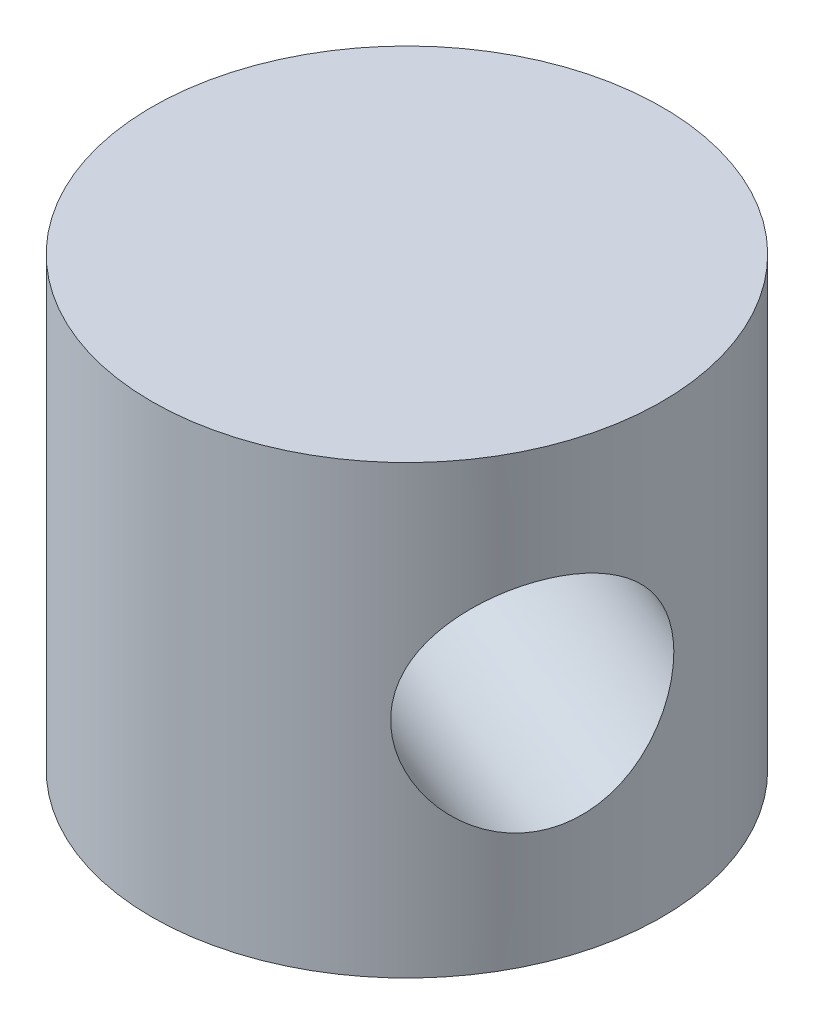
ISO-10303-21;
HEADER;
FILE_DESCRIPTION(('STEP AP214'),'2;1');
FILE_NAME('part.step','',(''),(''),'','','');
FILE_SCHEMA(('AUTOMOTIVE_DESIGN { 1 0 10303 214 1 1 1 1 }'));
ENDSEC;
DATA;
#1=APPLICATION_CONTEXT('core data for automotive mechanical design processes');
#2=APPLICATION_PROTOCOL_DEFINITION('international standard','automotive_design',2000,#1);
#3=PRODUCT_CONTEXT('',#1,'mechanical');
#4=PRODUCT('Part','Part','',(#3));
#5=PRODUCT_RELATED_PRODUCT_CATEGORY('part','',(#4));
#6=PRODUCT_DEFINITION_FORMATION('','',#4);
#7=PRODUCT_DEFINITION_CONTEXT('part definition',#1,'design');
#8=PRODUCT_DEFINITION('design','',#6,#7);
#9=PRODUCT_DEFINITION_SHAPE('','',#8);
#10=(LENGTH_UNIT() NAMED_UNIT(*) SI_UNIT(.MILLI.,.METRE.));
#11=(NAMED_UNIT(*) PLANE_ANGLE_UNIT() SI_UNIT($,.RADIAN.));
#12=(NAMED_UNIT(*) SI_UNIT($,.STERADIAN.) SOLID_ANGLE_UNIT());
#13=UNCERTAINTY_MEASURE_WITH_UNIT(LENGTH_MEASURE(1.E-05),#10,'distance_accuracy_value','');
#14=(GEOMETRIC_REPRESENTATION_CONTEXT(3) GLOBAL_UNCERTAINTY_ASSIGNED_CONTEXT((#13)) GLOBAL_UNIT_ASSIGNED_CONTEXT((#10,
#11,#12)) REPRESENTATION_CONTEXT('',''));
#15=CARTESIAN_POINT('',(0.,0.,0.));
#16=DIRECTION('',(0.,0.,1.));
#17=DIRECTION('',(1.,0.,0.));
#18=AXIS2_PLACEMENT_3D('',#15,#16,#17);
#19=CARTESIAN_POINT('',(0.,14.,0.));
#20=DIRECTION('',(0.,-1.,0.));
#21=DIRECTION('',(0.,0.,-1.));
#22=AXIS2_PLACEMENT_3D('',#19,#20,#21);
#23=CYLINDRICAL_SURFACE('',#22,8.);
#24=CARTESIAN_POINT('',(-5.39501646217355,7.,-5.90709720360825));
#25=CARTESIAN_POINT('',(-5.39501739878358,7.090523000141,-5.90709683834963));
#26=CARTESIAN_POINT('',(-5.39797305114615,7.18107623981146,-5.90440113833846));
#27=CARTESIAN_POINT('',(-5.40972838466958,7.36151941316238,-5.89363215856105));
#28=CARTESIAN_POINT('',(-5.41853178209816,7.45140888826371,-5.88555545913628));
#29=CARTESIAN_POINT('',(-5.44180280582978,7.63000304311961,-5.86404592315097));
#30=CARTESIAN_POINT('',(-5.45628220802113,7.71870486063056,-5.8506019501442));
#31=CARTESIAN_POINT('',(-5.49056930838726,7.89411067449536,-5.81843579403287));
#32=CARTESIAN_POINT('',(-5.51037925402175,7.9808138113885,-5.79971138443429));
#33=CARTESIAN_POINT('',(-5.57699313684112,8.23625324629269,-5.73593531244464));
#34=CARTESIAN_POINT('',(-5.63111222383345,8.40127467876389,-5.68316546566976));
#35=CARTESIAN_POINT('',(-5.75479417536612,8.71719474429244,-5.55788143992096));
#36=CARTESIAN_POINT('',(-5.82435382013894,8.86809631240543,-5.48537137659514));
#37=CARTESIAN_POINT('',(-5.97903292376719,9.16147371576962,-5.31648501375161));
#38=CARTESIAN_POINT('',(-6.06482664213419,9.30293294943535,-5.21895640973586));
#39=CARTESIAN_POINT('',(-6.24380942049427,9.56398304906696,-5.00344439772505));
#40=CARTESIAN_POINT('',(-6.3370013790544,9.68356528257335,-4.88545295090331));
#41=CARTESIAN_POINT('',(-6.53008806399734,9.90274296827423,-4.62443965861667));
#42=CARTESIAN_POINT('',(-6.6300949283572,10.0011830704645,-4.48052394945592));
#43=CARTESIAN_POINT('',(-6.82712801093451,10.1674229235738,-4.17413669302737));
#44=CARTESIAN_POINT('',(-6.92415558374197,10.2352367974497,-4.0116737420107));
#45=CARTESIAN_POINT('',(-7.10503499192602,10.3345791988528,-3.68130491328499));
#46=CARTESIAN_POINT('',(-7.18931506350882,10.3678659539145,-3.51416397127766));
#47=CARTESIAN_POINT('',(-7.34685759134396,10.4029004598221,-3.17161830124841));
#48=CARTESIAN_POINT('',(-7.42012469510924,10.4046615518764,-2.99621710035895));
#49=CARTESIAN_POINT('',(-7.54897496223702,10.3774940595107,-2.65410946833767));
#50=CARTESIAN_POINT('',(-7.60538369816813,10.3505001780629,-2.4875550739392));
#51=CARTESIAN_POINT('',(-7.70561818019824,10.2699187884587,-2.15714313858101));
#52=CARTESIAN_POINT('',(-7.74944299662975,10.2163293162862,-1.9932857977152));
#53=CARTESIAN_POINT('',(-7.82543972038249,10.0834554496467,-1.67046030653175));
#54=CARTESIAN_POINT('',(-7.85742312056618,10.003790544129,-1.51160528670168));
#55=CARTESIAN_POINT('',(-7.91014572178526,9.82140939840707,-1.205704564771));
#56=CARTESIAN_POINT('',(-7.93088089205663,9.71868491350131,-1.05866311207953));
#57=CARTESIAN_POINT('',(-7.96427257621075,9.48439898425984,-0.770052662821825));
#58=CARTESIAN_POINT('',(-7.97622976797715,9.35128100486895,-0.629664514422268));
#59=CARTESIAN_POINT('',(-7.99243128574457,9.06435209734065,-0.371267150105787));
#60=CARTESIAN_POINT('',(-7.99667239651045,8.91053257167743,-0.253267281559057));
#61=CARTESIAN_POINT('',(-8.00063335493223,8.57971966238651,-0.0403728986407438));
#62=CARTESIAN_POINT('',(-8.00018803421697,8.40209919226044,0.0535571126369195));
#63=CARTESIAN_POINT('',(-7.99767741778646,8.03283896754991,0.207787237190188));
#64=CARTESIAN_POINT('',(-7.99561333750852,7.84120982915227,0.268112524301288));
#65=CARTESIAN_POINT('',(-7.99249941027851,7.46300339602884,0.348536744928496));
#66=CARTESIAN_POINT('',(-7.99139109378033,7.27694176494296,0.371050528466116));
#67=CARTESIAN_POINT('',(-7.99087830684536,6.90384753499212,0.381986516522997));
#68=CARTESIAN_POINT('',(-7.99147320612462,6.7168153208653,0.370421332096988));
#69=CARTESIAN_POINT('',(-7.99379879202815,6.36046323481976,0.315939263595305));
#70=CARTESIAN_POINT('',(-7.99544974833354,6.19080215586855,0.275200897953546));
#71=CARTESIAN_POINT('',(-7.99843890884735,5.86025433904409,0.166981919420543));
#72=CARTESIAN_POINT('',(-7.99977703784189,5.69936971843113,0.0994948857697852));
#73=CARTESIAN_POINT('',(-8.00018095394254,5.38317309821528,-0.0627056027196794));
#74=CARTESIAN_POINT('',(-7.9991461862667,5.2284012075454,-0.158468327204054));
#75=CARTESIAN_POINT('',(-7.9920484312117,4.93520988068559,-0.372280855343809));
#76=CARTESIAN_POINT('',(-7.98598320313174,4.79679776296835,-0.490340572571313));
#77=CARTESIAN_POINT('',(-7.96540147158254,4.52795243224838,-0.75603037960453));
#78=CARTESIAN_POINT('',(-7.95020782645414,4.39920853374453,-0.90532429065251));
#79=CARTESIAN_POINT('',(-7.90784815806925,4.16735177931507,-1.22118937922614));
#80=CARTESIAN_POINT('',(-7.8806810370567,4.06424127487457,-1.38776213984588));
#81=CARTESIAN_POINT('',(-7.81187589218991,3.8865339544999,-1.73372103592866));
#82=CARTESIAN_POINT('',(-7.77017793115304,3.81205796957249,-1.91315775951674));
#83=CARTESIAN_POINT('',(-7.67111923991,3.69530599113611,-2.27806423388292));
#84=CARTESIAN_POINT('',(-7.61376828047193,3.65300997272457,-2.4635301577628));
#85=CARTESIAN_POINT('',(-7.48856302688684,3.60441379589686,-2.82038737521534));
#86=CARTESIAN_POINT('',(-7.42176634007661,3.59573473320773,-2.9918278464269));
#87=CARTESIAN_POINT('',(-7.27689056077471,3.60816517201317,-3.32873267617656));
#88=CARTESIAN_POINT('',(-7.19881359295291,3.62926907035936,-3.49419815280058));
#89=CARTESIAN_POINT('',(-7.03752588374139,3.69895846425078,-3.8083138214667));
#90=CARTESIAN_POINT('',(-6.95462311459545,3.7464688021909,-3.95736411795975));
#91=CARTESIAN_POINT('',(-6.78452656235538,3.86642559559092,-4.24237771735119));
#92=CARTESIAN_POINT('',(-6.69733198420749,3.93887668631584,-4.37833858154996));
#93=CARTESIAN_POINT('',(-6.51837661334299,4.11032785222912,-4.64081312878653));
#94=CARTESIAN_POINT('',(-6.42658863842499,4.210386305035,-4.76661506483792));
#95=CARTESIAN_POINT('',(-6.24675204823898,4.43270568683477,-4.99998290326825));
#96=CARTESIAN_POINT('',(-6.15870490272508,4.55497524472993,-5.10754168676177));
#97=CARTESIAN_POINT('',(-5.98487935028355,4.82846913105678,-5.31039702104811));
#98=CARTESIAN_POINT('',(-5.89970958865767,4.98113579405702,-5.40427382006541));
#99=CARTESIAN_POINT('',(-5.74445925952968,5.30571720020382,-5.56902704624976));
#100=CARTESIAN_POINT('',(-5.67438736386862,5.47764291957361,-5.63989026677576));
#101=CARTESIAN_POINT('',(-5.58499732637856,5.74625304577109,-5.72796096454177));
#102=CARTESIAN_POINT('',(-5.55783643769012,5.83749594424632,-5.75426611146949));
#103=CARTESIAN_POINT('',(-5.50930716636968,6.02301719311669,-5.80074719210668));
#104=CARTESIAN_POINT('',(-5.48793592547853,6.1172940198946,-5.82092615081591));
#105=CARTESIAN_POINT('',(-5.45157211083415,6.30791085175489,-5.8549962506666));
#106=CARTESIAN_POINT('',(-5.43656272956912,6.40424470520901,-5.86890396621116));
#107=CARTESIAN_POINT('',(-5.41325108022949,6.59836825439456,-5.89041320331085));
#108=CARTESIAN_POINT('',(-5.40494364955115,6.69615677032478,-5.89801957899548));
#109=CARTESIAN_POINT('',(-5.39840543589642,6.82846821876692,-5.90400045131156));
#110=CARTESIAN_POINT('',(-5.39713526767001,6.86275023837152,-5.90516147959401));
#111=CARTESIAN_POINT('',(-5.39544059739817,6.93135338895923,-5.90670993033011));
#112=CARTESIAN_POINT('',(-5.39501610701974,6.9656745204754,-5.90709734211092));
#113=CARTESIAN_POINT('',(-5.39501646217355,7.,-5.90709720360825));
#114=B_SPLINE_CURVE_WITH_KNOTS('',3,(#24,#25,#26,#27,#28,#29,#30,#31,#32,#33,#34,#35,#36,#37,
#38,#39,#40,#41,#42,#43,#44,#45,#46,#47,#48,#49,#50,#51,#52,#53,#54,#55,#56,#57,#58,#59,#60,#61,
#62,#63,#64,#65,#66,#67,#68,#69,#70,#71,#72,#73,#74,#75,#76,#77,#78,#79,#80,#81,#82,#83,#84,#85,
#86,#87,#88,#89,#90,#91,#92,#93,#94,#95,#96,#97,#98,#99,#100,#101,#102,#103,#104,#105,#106,#107,
#108,#109,#110,#111,#112,#113),.UNSPECIFIED.,.T.,.F.,(4,2,2,2,2,2,2,2,2,2,2,2,2,2,2,2,2,2,2,2,2,
2,2,2,2,2,2,2,2,2,2,2,2,2,2,2,2,2,2,2,2,2,2,2,4),(0.,0.271533101303065,0.543238928388109,
0.815511466907409,1.08789898112825,1.62979796627975,2.17158405703762,2.74521548008885,
3.31907276680709,3.91901055560994,4.518671406341,5.08602169361362,5.65313188070349,
6.18436069062124,6.71562873626018,7.25502349345062,7.79461141340451,8.37354466653554,
8.95271910176149,9.55237239074671,10.1515758637073,10.7108099920759,11.2698371996708,
11.7909672889951,12.3122225463985,12.8559725303037,13.3999648450627,13.9903875055115,
14.5808643085448,15.1738061326552,15.7663786793264,16.3161578611251,16.8658336252783,
17.3946144745139,17.9234936513282,18.4764471857591,19.029616001036,19.622198872516,
20.2151212069326,20.5110879967455,20.8069084049778,21.1019423336194,21.3967487760209,
21.4997101815325,21.602673007494),.UNSPECIFIED.);
#115=CARTESIAN_POINT('',(-5.39501646217355,7.,-5.90709720360825));
#116=VERTEX_POINT('',#115);
#117=EDGE_CURVE('E45',#116,#116,#114,.T.);
#118=ORIENTED_EDGE('',*,*,#117,.T.);
#119=EDGE_LOOP('',(#118));
#120=FACE_BOUND('',#119,.T.);
#121=CARTESIAN_POINT('',(7.99107210329432,7.,-0.377844729950489));
#122=CARTESIAN_POINT('',(7.99107250911416,6.909476999859,-0.377843810188309));
#123=CARTESIAN_POINT('',(7.99126419807367,6.81892376018854,-0.373848070609539));
#124=CARTESIAN_POINT('',(7.99199304211696,6.63848058683762,-0.357922381360591));
#125=CARTESIAN_POINT('',(7.99253041687871,6.54859111173629,-0.345987386251714));
#126=CARTESIAN_POINT('',(7.99383837678548,6.36999695688039,-0.314325264959814));
#127=CARTESIAN_POINT('',(7.99460944601214,6.28129513936944,-0.294581938232198));
#128=CARTESIAN_POINT('',(7.99620178079454,6.10588932550463,-0.247595436761706));
#129=CARTESIAN_POINT('',(7.99702306740978,6.0191861886115,-0.220349098491172));
#130=CARTESIAN_POINT('',(7.99921139919154,5.76374675370731,-0.128153610821135));
#131=CARTESIAN_POINT('',(8.00031440561068,5.59872532123611,-0.0525737478789054));
#132=CARTESIAN_POINT('',(7.99952850816686,5.28280525570757,0.123473673595999));
#133=CARTESIAN_POINT('',(7.99764022756389,5.13190368759457,0.223936043968199));
#134=CARTESIAN_POINT('',(7.98804509116707,4.83852628423038,0.452750733206637));
#135=CARTESIAN_POINT('',(7.98000275252289,4.69706705056465,0.582395291525249));
#136=CARTESIAN_POINT('',(7.95472246838215,4.43601695093304,0.861395595296059));
#137=CARTESIAN_POINT('',(7.93748090342162,4.31643471742665,1.01075908180154));
#138=CARTESIAN_POINT('',(7.89008242728338,4.09725703172577,1.33195028826948));
#139=CARTESIAN_POINT('',(7.859374155501,3.99881692953554,1.50449044680214));
#140=CARTESIAN_POINT('',(7.78275075172103,3.83257707642619,1.8606140777576));
#141=CARTESIAN_POINT('',(7.73684264592567,3.76476320255033,2.04419241569603));
#142=CARTESIAN_POINT('',(7.63185030045237,3.66542080114716,2.40590712467345));
#143=CARTESIAN_POINT('',(7.57360928988738,3.63213404608552,2.58380375097499));
#144=CARTESIAN_POINT('',(7.44348944808794,3.59709954017792,2.9376766249037));
#145=CARTESIAN_POINT('',(7.37161639875075,3.59533844812355,3.11365365336647));
#146=CARTESIAN_POINT('',(7.22147724976295,3.62250594048925,3.44696770822664));
#147=CARTESIAN_POINT('',(7.14390336151923,3.64949982193705,3.60477963314216));
#148=CARTESIAN_POINT('',(6.98174375182779,3.7300812115413,3.90961279964427));
#149=CARTESIAN_POINT('',(6.89715751292031,3.78367068371379,4.05663324338716));
#150=CARTESIAN_POINT('',(6.72317932146249,3.91654455035331,4.33898654808901));
#151=CARTESIAN_POINT('',(6.63373364933866,3.99620945587103,4.47410622449047));
#152=CARTESIAN_POINT('',(6.45520977806745,4.17859060159293,4.72804352333284));
#153=CARTESIAN_POINT('',(6.36613172198667,4.28131508649869,4.84685529051383));
#154=CARTESIAN_POINT('',(6.18611386784174,4.51560101574016,5.0749003917119));
#155=CARTESIAN_POINT('',(6.09551193940586,4.64871899513105,5.18280357613986));
#156=CARTESIAN_POINT('',(5.92463660424363,4.93564790265935,5.37731143432782));
#157=CARTESIAN_POINT('',(5.84436751607697,5.08946742832257,5.46390721645644));
#158=CARTESIAN_POINT('',(5.69693175292594,5.42028033761349,5.61753795300958));
#159=CARTESIAN_POINT('',(5.6303287176324,5.59790080773956,5.68377299674664));
#160=CARTESIAN_POINT('',(5.5197079154745,5.96716103245009,5.79127310206994));
#161=CARTESIAN_POINT('',(5.47567324427106,6.15879017084773,5.83255685704009));
#162=CARTESIAN_POINT('',(5.41671070121817,6.53699660397116,5.88733979528753));
#163=CARTESIAN_POINT('',(5.40003721537882,6.72305823505704,5.9025086345511));
#164=CARTESIAN_POINT('',(5.39195624955659,7.09615246500788,5.90989489047687));
#165=CARTESIAN_POINT('',(5.40053942324692,7.2831846791347,5.9021207972589));
#166=CARTESIAN_POINT('',(5.44063574203986,7.63953676518024,5.86516150401251));
#167=CARTESIAN_POINT('',(5.47055499192995,7.80919784413145,5.83746351531482));
#168=CARTESIAN_POINT('',(5.54904422910939,8.13974566095591,5.76289997166047));
#169=CARTESIAN_POINT('',(5.59761869431614,8.30063028156887,5.71602981452329));
#170=CARTESIAN_POINT('',(5.71237168217792,8.61682690178471,5.6013959914551));
#171=CARTESIAN_POINT('',(5.77921944394588,8.77159879245459,5.53281795640431));
#172=CARTESIAN_POINT('',(5.92508073606152,9.0647901193144,5.37632304026103));
#173=CARTESIAN_POINT('',(6.00409967500085,9.20320223703165,5.28839755412418));
#174=CARTESIAN_POINT('',(6.17701799696708,9.47204756775162,5.08563183916404));
#175=CARTESIAN_POINT('',(6.27161180429561,9.60079146625547,4.96913492785999));
#176=CARTESIAN_POINT('',(6.46450977436655,9.83264822068493,4.71545113092409));
#177=CARTESIAN_POINT('',(6.56281427655831,9.93575872512543,4.57826234897228));
#178=CARTESIAN_POINT('',(6.75821321287174,10.1134660455001,4.28459423455307));
#179=CARTESIAN_POINT('',(6.85530088220552,10.1879420304275,4.12803676207094));
#180=CARTESIAN_POINT('',(7.04263674481708,10.3046940088639,3.79959402136151));
#181=CARTESIAN_POINT('',(7.13288915998596,10.3469900272754,3.62771835983473));
#182=CARTESIAN_POINT('',(7.29601975499661,10.3955862041031,3.2865265689828));
#183=CARTESIAN_POINT('',(7.36968195374247,10.4042652667923,3.11792196342889));
#184=CARTESIAN_POINT('',(7.50479536516973,10.3918348279868,2.77698469384771));
#185=CARTESIAN_POINT('',(7.566248872224,10.3707309296406,2.60465273706258));
#186=CARTESIAN_POINT('',(7.67365186697717,10.3010415357492,2.26827946945304));
#187=CARTESIAN_POINT('',(7.7201019111486,10.2535311978091,2.10417202473099));
#188=CARTESIAN_POINT('',(7.80072617370872,10.1335744044091,1.78220103658352));
#189=CARTESIAN_POINT('',(7.83489810778336,10.0611233136842,1.62433865989526));
#190=CARTESIAN_POINT('',(7.89333982972844,9.88967214777088,1.31208479227408));
#191=CARTESIAN_POINT('',(7.9170880707255,9.789613694965,1.15817839051194));
#192=CARTESIAN_POINT('',(7.95436449916623,9.56729431316523,0.865924707787362));
#193=CARTESIAN_POINT('',(7.96788870404698,9.44502475527007,0.727583507770536));
#194=CARTESIAN_POINT('',(7.98789090920552,9.17153086894322,0.461189962205285));
#195=CARTESIAN_POINT('',(7.99379819831154,9.01886420594298,0.334573037489186));
#196=CARTESIAN_POINT('',(8.00007181836199,8.69428279979618,0.108283550495291));
#197=CARTESIAN_POINT('',(8.00043497321281,8.52235708042639,0.00862646492981311));
#198=CARTESIAN_POINT('',(7.99925476670912,8.25374695422891,-0.116855142168899));
#199=CARTESIAN_POINT('',(7.99857516134354,8.16250405575369,-0.154660072611655));
#200=CARTESIAN_POINT('',(7.99699447625556,7.97698280688331,-0.221839552118026));
#201=CARTESIAN_POINT('',(7.99609350623792,7.8827059801054,-0.251218261498176));
#202=CARTESIAN_POINT('',(7.99437345736526,7.69208914824511,-0.301019267022192));
#203=CARTESIAN_POINT('',(7.9935541671596,7.59575529479098,-0.321465167373765));
#204=CARTESIAN_POINT('',(7.99221721312616,7.40163174560544,-0.353155746880253));
#205=CARTESIAN_POINT('',(7.9916993172161,7.30384322967522,-0.364407508491553));
#206=CARTESIAN_POINT('',(7.99128777260356,7.17153178123308,-0.373259045221859));
#207=CARTESIAN_POINT('',(7.99120721124941,7.13724976162848,-0.374978005333159));
#208=CARTESIAN_POINT('',(7.99109929928618,7.06864661104077,-0.377271029977727));
#209=CARTESIAN_POINT('',(7.99107194941121,7.0343254795246,-0.377845078715751));
#210=CARTESIAN_POINT('',(7.99107210329432,7.,-0.377844729950489));
#211=B_SPLINE_CURVE_WITH_KNOTS('',3,(#121,#122,#123,#124,#125,#126,#127,#128,#129,#130,#131,
#132,#133,#134,#135,#136,#137,#138,#139,#140,#141,#142,#143,#144,#145,#146,#147,#148,#149,#150,
#151,#152,#153,#154,#155,#156,#157,#158,#159,#160,#161,#162,#163,#164,#165,#166,#167,#168,#169,
#170,#171,#172,#173,#174,#175,#176,#177,#178,#179,#180,#181,#182,#183,#184,#185,#186,#187,#188,
#189,#190,#191,#192,#193,#194,#195,#196,#197,#198,#199,#200,#201,#202,#203,#204,#205,#206,#207,
#208,#209,#210),.UNSPECIFIED.,.T.,.F.,(4,2,2,2,2,2,2,2,2,2,2,2,2,2,2,2,2,2,2,2,2,2,2,2,2,2,2,2,
2,2,2,2,2,2,2,2,2,2,2,2,2,2,2,2,4),(0.,0.271533101303065,0.543238928388109,0.815511466907409,
1.08789898112825,1.62979796627975,2.17158405703762,2.74521548008885,3.31907276680709,
3.91901055560994,4.518671406341,5.08602169361362,5.65313188070348,6.18436069062124,
6.71562873626018,7.25502349345062,7.79461141340451,8.37354466653554,8.95271910176149,
9.55237239074671,10.1515758637073,10.7108099920759,11.2698371996708,11.7909672889951,
12.3122225463985,12.8559725303037,13.3999648450627,13.9903875055115,14.5808643085448,
15.1738061326552,15.7663786793264,16.3161578611251,16.8658336252783,17.3946144745139,
17.9234936513282,18.4764471857591,19.029616001036,19.622198872516,20.2151212069326,
20.5110879967455,20.8069084049778,21.1019423336194,21.3967487760209,21.4997101815325,
21.602673007494),.UNSPECIFIED.);
#212=CARTESIAN_POINT('',(7.99107210329432,7.,-0.377844729950489));
#213=VERTEX_POINT('',#212);
#214=EDGE_CURVE('E10',#213,#213,#211,.T.);
#215=ORIENTED_EDGE('',*,*,#214,.T.);
#216=EDGE_LOOP('',(#215));
#217=FACE_BOUND('',#216,.T.);
#218=CARTESIAN_POINT('',(0.,14.,0.));
#219=DIRECTION('',(0.,1.,0.));
#220=DIRECTION('',(0.,0.,1.));
#221=AXIS2_PLACEMENT_3D('',#218,#219,#220);
#222=CIRCLE('',#221,8.);
#223=CARTESIAN_POINT('',(0.,14.,8.));
#224=VERTEX_POINT('',#223);
#225=EDGE_CURVE('E54',#224,#224,#222,.T.);
#226=ORIENTED_EDGE('',*,*,#225,.F.);
#227=EDGE_LOOP('',(#226));
#228=FACE_BOUND('',#227,.T.);
#229=CARTESIAN_POINT('',(0.,0.,0.));
#230=DIRECTION('',(0.,1.,0.));
#231=DIRECTION('',(0.,0.,1.));
#232=AXIS2_PLACEMENT_3D('',#229,#230,#231);
#233=CIRCLE('',#232,8.);
#234=CARTESIAN_POINT('',(0.,0.,8.));
#235=VERTEX_POINT('',#234);
#236=EDGE_CURVE('E59',#235,#235,#233,.T.);
#237=ORIENTED_EDGE('',*,*,#236,.T.);
#238=EDGE_LOOP('',(#237));
#239=FACE_BOUND('',#238,.T.);
#240=ADVANCED_FACE('F41',(#120,#217,#228,#239),#23,.T.);
#241=CARTESIAN_POINT('',(0.,14.,0.));
#242=DIRECTION('',(0.,1.,0.));
#243=DIRECTION('',(0.,0.,1.));
#244=AXIS2_PLACEMENT_3D('',#241,#242,#243);
#245=PLANE('',#244);
#246=ORIENTED_EDGE('',*,*,#225,.T.);
#247=EDGE_LOOP('',(#246));
#248=FACE_BOUND('',#247,.T.);
#249=ADVANCED_FACE('F71',(#248),#245,.T.);
#250=CARTESIAN_POINT('',(0.,0.,0.));
#251=DIRECTION('',(0.,1.,0.));
#252=DIRECTION('',(0.,0.,1.));
#253=AXIS2_PLACEMENT_3D('',#250,#251,#252);
#254=PLANE('',#253);
#255=ORIENTED_EDGE('',*,*,#236,.F.);
#256=EDGE_LOOP('',(#255));
#257=FACE_BOUND('',#256,.T.);
#258=ADVANCED_FACE('F69',(#257),#254,.F.);
#259=CARTESIAN_POINT('',(7.39404933359852,7.,3.0541831072009));
#260=DIRECTION('',(0.924256166699814,0.,0.381772888400113));
#261=DIRECTION('',(0.381772888400113,0.,-0.924256166699814));
#262=AXIS2_PLACEMENT_3D('',#259,#260,#261);
#263=CYLINDRICAL_SURFACE('',#262,3.4);
#264=ORIENTED_EDGE('',*,*,#214,.F.);
#265=EDGE_LOOP('',(#264));
#266=FACE_BOUND('',#265,.T.);
#267=ORIENTED_EDGE('',*,*,#117,.F.);
#268=EDGE_LOOP('',(#267));
#269=FACE_BOUND('',#268,.T.);
#270=ADVANCED_FACE('F65',(#266,#269),#263,.F.);
#271=CLOSED_SHELL('',(#240,#249,#258,#270));
#272=MANIFOLD_SOLID_BREP('B2',#271);
#273=ADVANCED_BREP_SHAPE_REPRESENTATION('',(#18,#272),#14);
#274=SHAPE_DEFINITION_REPRESENTATION(#9,#273);
ENDSEC;
END-ISO-10303-21;
